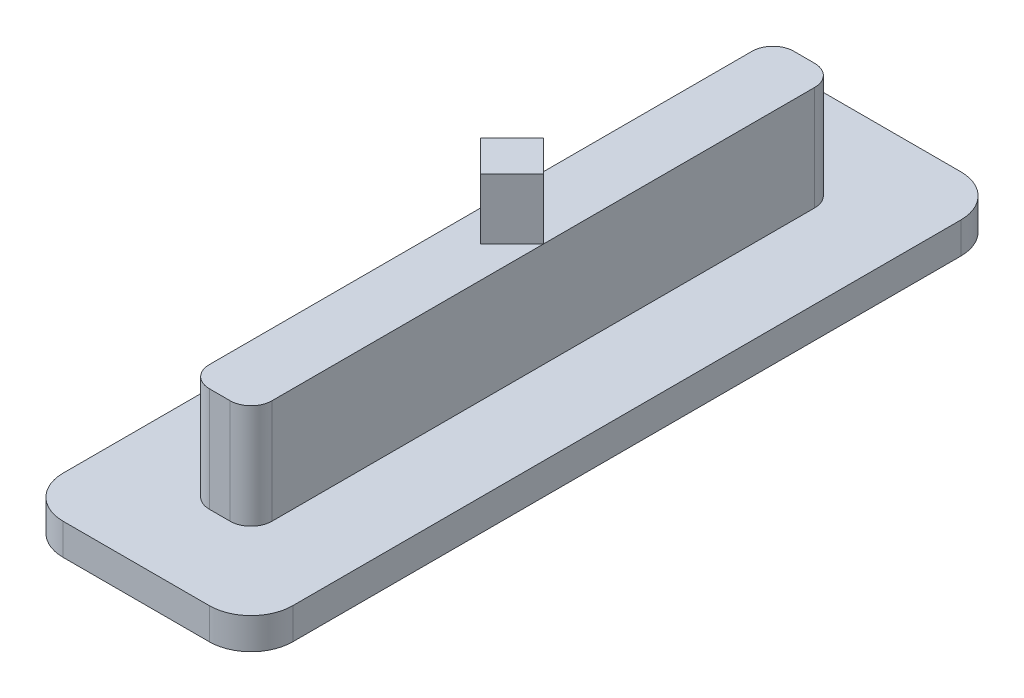
ISO-10303-21;
HEADER;
FILE_DESCRIPTION(('STEP AP214'),'2;1');
FILE_NAME('part.step','',(''),(''),'','','');
FILE_SCHEMA(('AUTOMOTIVE_DESIGN { 1 0 10303 214 1 1 1 1 }'));
ENDSEC;
DATA;
#1=APPLICATION_CONTEXT('core data for automotive mechanical design processes');
#2=APPLICATION_PROTOCOL_DEFINITION('international standard','automotive_design',2000,#1);
#3=PRODUCT_CONTEXT('',#1,'mechanical');
#4=PRODUCT('Part','Part','',(#3));
#5=PRODUCT_RELATED_PRODUCT_CATEGORY('part','',(#4));
#6=PRODUCT_DEFINITION_FORMATION('','',#4);
#7=PRODUCT_DEFINITION_CONTEXT('part definition',#1,'design');
#8=PRODUCT_DEFINITION('design','',#6,#7);
#9=PRODUCT_DEFINITION_SHAPE('','',#8);
#10=(LENGTH_UNIT() NAMED_UNIT(*) SI_UNIT(.MILLI.,.METRE.));
#11=(NAMED_UNIT(*) PLANE_ANGLE_UNIT() SI_UNIT($,.RADIAN.));
#12=(NAMED_UNIT(*) SI_UNIT($,.STERADIAN.) SOLID_ANGLE_UNIT());
#13=UNCERTAINTY_MEASURE_WITH_UNIT(LENGTH_MEASURE(1.E-05),#10,'distance_accuracy_value','');
#14=(GEOMETRIC_REPRESENTATION_CONTEXT(3) GLOBAL_UNCERTAINTY_ASSIGNED_CONTEXT((#13)) GLOBAL_UNIT_ASSIGNED_CONTEXT((#10,
#11,#12)) REPRESENTATION_CONTEXT('',''));
#15=CARTESIAN_POINT('',(0.,0.,0.));
#16=DIRECTION('',(0.,0.,1.));
#17=DIRECTION('',(1.,0.,0.));
#18=AXIS2_PLACEMENT_3D('',#15,#16,#17);
#19=CARTESIAN_POINT('',(0.,5.,0.));
#20=DIRECTION('',(0.,-1.,0.));
#21=DIRECTION('',(0.,0.,-1.));
#22=AXIS2_PLACEMENT_3D('',#19,#20,#21);
#23=PLANE('',#22);
#24=DIRECTION('',(0.707106781186548,0.,0.707106781186548));
#25=VECTOR('',#24,1.);
#26=CARTESIAN_POINT('',(0.,5.,1.5));
#27=LINE('',#26,#25);
#28=CARTESIAN_POINT('',(-1.5,5.,0.));
#29=VERTEX_POINT('',#28);
#30=CARTESIAN_POINT('',(0.,5.,1.5));
#31=VERTEX_POINT('',#30);
#32=EDGE_CURVE('E192',#29,#31,#27,.T.);
#33=ORIENTED_EDGE('',*,*,#32,.F.);
#34=DIRECTION('',(0.,0.,1.));
#35=VECTOR('',#34,1.);
#36=CARTESIAN_POINT('',(-1.5,5.,-14.));
#37=LINE('',#36,#35);
#38=CARTESIAN_POINT('',(-1.5,5.,13.));
#39=VERTEX_POINT('',#38);
#40=EDGE_CURVE('E226',#29,#39,#37,.T.);
#41=ORIENTED_EDGE('',*,*,#40,.T.);
#42=CARTESIAN_POINT('',(-0.499999999999998,5.,13.));
#43=DIRECTION('',(0.,-1.,0.));
#44=DIRECTION('',(0.,0.,-1.));
#45=AXIS2_PLACEMENT_3D('',#42,#43,#44);
#46=CIRCLE('',#45,1.);
#47=CARTESIAN_POINT('',(-0.499999999999998,5.,14.));
#48=VERTEX_POINT('',#47);
#49=EDGE_CURVE('E257',#39,#48,#46,.F.);
#50=ORIENTED_EDGE('',*,*,#49,.T.);
#51=DIRECTION('',(1.,0.,0.));
#52=VECTOR('',#51,1.);
#53=CARTESIAN_POINT('',(1.5,5.,14.));
#54=LINE('',#53,#52);
#55=CARTESIAN_POINT('',(0.500000000000002,5.,14.));
#56=VERTEX_POINT('',#55);
#57=EDGE_CURVE('E225',#48,#56,#54,.T.);
#58=ORIENTED_EDGE('',*,*,#57,.T.);
#59=CARTESIAN_POINT('',(0.500000000000002,5.,13.));
#60=DIRECTION('',(0.,-1.,0.));
#61=DIRECTION('',(0.,0.,-1.));
#62=AXIS2_PLACEMENT_3D('',#59,#60,#61);
#63=CIRCLE('',#62,1.);
#64=CARTESIAN_POINT('',(1.5,5.,13.));
#65=VERTEX_POINT('',#64);
#66=EDGE_CURVE('E259',#56,#65,#63,.F.);
#67=ORIENTED_EDGE('',*,*,#66,.T.);
#68=DIRECTION('',(0.,0.,-1.));
#69=VECTOR('',#68,1.);
#70=CARTESIAN_POINT('',(1.5,5.,-14.));
#71=LINE('',#70,#69);
#72=CARTESIAN_POINT('',(1.5,5.,0.));
#73=VERTEX_POINT('',#72);
#74=EDGE_CURVE('E230',#65,#73,#71,.T.);
#75=ORIENTED_EDGE('',*,*,#74,.T.);
#76=DIRECTION('',(0.707106781186548,0.,-0.707106781186548));
#77=VECTOR('',#76,1.);
#78=CARTESIAN_POINT('',(1.5,5.,0.));
#79=LINE('',#78,#77);
#80=EDGE_CURVE('E56',#31,#73,#79,.T.);
#81=ORIENTED_EDGE('',*,*,#80,.F.);
#82=EDGE_LOOP('',(#33,#41,#50,#58,#67,#75,#81));
#83=FACE_BOUND('',#82,.T.);
#84=ADVANCED_FACE('F33',(#83),#23,.F.);
#85=DIRECTION('',(-0.707106781186548,0.,0.707106781186548));
#86=VECTOR('',#85,1.);
#87=CARTESIAN_POINT('',(-1.5,5.,0.));
#88=LINE('',#87,#86);
#89=CARTESIAN_POINT('',(0.,5.,-1.5));
#90=VERTEX_POINT('',#89);
#91=EDGE_CURVE('E48',#90,#29,#88,.T.);
#92=ORIENTED_EDGE('',*,*,#91,.F.);
#93=DIRECTION('',(-0.707106781186548,0.,-0.707106781186548));
#94=VECTOR('',#93,1.);
#95=CARTESIAN_POINT('',(0.,5.,-1.5));
#96=LINE('',#95,#94);
#97=EDGE_CURVE('E576',#73,#90,#96,.T.);
#98=ORIENTED_EDGE('',*,*,#97,.F.);
#99=CARTESIAN_POINT('',(1.5,5.,-13.));
#100=VERTEX_POINT('',#99);
#101=EDGE_CURVE('E229',#73,#100,#71,.T.);
#102=ORIENTED_EDGE('',*,*,#101,.T.);
#103=CARTESIAN_POINT('',(0.499999999999999,5.,-13.));
#104=DIRECTION('',(0.,-1.,0.));
#105=DIRECTION('',(0.,0.,-1.));
#106=AXIS2_PLACEMENT_3D('',#103,#104,#105);
#107=CIRCLE('',#106,1.);
#108=CARTESIAN_POINT('',(0.499999999999999,5.,-14.));
#109=VERTEX_POINT('',#108);
#110=EDGE_CURVE('E263',#100,#109,#107,.F.);
#111=ORIENTED_EDGE('',*,*,#110,.T.);
#112=DIRECTION('',(-1.,0.,0.));
#113=VECTOR('',#112,1.);
#114=CARTESIAN_POINT('',(1.5,5.,-14.));
#115=LINE('',#114,#113);
#116=CARTESIAN_POINT('',(-0.500000000000002,5.,-14.));
#117=VERTEX_POINT('',#116);
#118=EDGE_CURVE('E232',#109,#117,#115,.T.);
#119=ORIENTED_EDGE('',*,*,#118,.T.);
#120=CARTESIAN_POINT('',(-0.500000000000002,5.,-13.));
#121=DIRECTION('',(0.,-1.,0.));
#122=DIRECTION('',(0.,0.,-1.));
#123=AXIS2_PLACEMENT_3D('',#120,#121,#122);
#124=CIRCLE('',#123,1.);
#125=CARTESIAN_POINT('',(-1.5,5.,-13.));
#126=VERTEX_POINT('',#125);
#127=EDGE_CURVE('E261',#117,#126,#124,.F.);
#128=ORIENTED_EDGE('',*,*,#127,.T.);
#129=EDGE_CURVE('E223',#126,#29,#37,.T.);
#130=ORIENTED_EDGE('',*,*,#129,.T.);
#131=EDGE_LOOP('',(#92,#98,#102,#111,#119,#128,#130));
#132=FACE_BOUND('',#131,.T.);
#133=ADVANCED_FACE('F362',(#132),#23,.F.);
#134=CARTESIAN_POINT('',(-1.5,5.,-14.));
#135=DIRECTION('',(1.,0.,0.));
#136=DIRECTION('',(0.,0.,-1.));
#137=AXIS2_PLACEMENT_3D('',#134,#135,#136);
#138=PLANE('',#137);
#139=ORIENTED_EDGE('',*,*,#129,.F.);
#140=DIRECTION('',(0.,-1.,0.));
#141=VECTOR('',#140,1.);
#142=CARTESIAN_POINT('',(-1.5,5.,-13.));
#143=LINE('',#142,#141);
#144=CARTESIAN_POINT('',(-1.5,0.,-13.));
#145=VERTEX_POINT('',#144);
#146=EDGE_CURVE('E268',#126,#145,#143,.T.);
#147=ORIENTED_EDGE('',*,*,#146,.T.);
#148=DIRECTION('',(0.,0.,1.));
#149=VECTOR('',#148,1.);
#150=CARTESIAN_POINT('',(-1.5,0.,-14.));
#151=LINE('',#150,#149);
#152=CARTESIAN_POINT('',(-1.5,0.,13.));
#153=VERTEX_POINT('',#152);
#154=EDGE_CURVE('E214',#145,#153,#151,.T.);
#155=ORIENTED_EDGE('',*,*,#154,.T.);
#156=DIRECTION('',(0.,-1.,0.));
#157=VECTOR('',#156,1.);
#158=CARTESIAN_POINT('',(-1.5,5.,13.));
#159=LINE('',#158,#157);
#160=EDGE_CURVE('E265',#153,#39,#159,.F.);
#161=ORIENTED_EDGE('',*,*,#160,.T.);
#162=ORIENTED_EDGE('',*,*,#40,.F.);
#163=EDGE_LOOP('',(#139,#147,#155,#161,#162));
#164=FACE_BOUND('',#163,.T.);
#165=ADVANCED_FACE('F367',(#164),#138,.F.);
#166=CARTESIAN_POINT('',(1.5,5.,14.));
#167=DIRECTION('',(0.,0.,-1.));
#168=DIRECTION('',(-1.,0.,0.));
#169=AXIS2_PLACEMENT_3D('',#166,#167,#168);
#170=PLANE('',#169);
#171=DIRECTION('',(1.,0.,0.));
#172=VECTOR('',#171,1.);
#173=CARTESIAN_POINT('',(1.5,0.,14.));
#174=LINE('',#173,#172);
#175=CARTESIAN_POINT('',(-0.499999999999998,0.,14.));
#176=VERTEX_POINT('',#175);
#177=CARTESIAN_POINT('',(0.500000000000002,0.,14.));
#178=VERTEX_POINT('',#177);
#179=EDGE_CURVE('E238',#176,#178,#174,.T.);
#180=ORIENTED_EDGE('',*,*,#179,.T.);
#181=DIRECTION('',(0.,-1.,0.));
#182=VECTOR('',#181,1.);
#183=CARTESIAN_POINT('',(0.500000000000002,5.,14.));
#184=LINE('',#183,#182);
#185=EDGE_CURVE('E274',#178,#56,#184,.F.);
#186=ORIENTED_EDGE('',*,*,#185,.T.);
#187=ORIENTED_EDGE('',*,*,#57,.F.);
#188=DIRECTION('',(0.,-1.,0.));
#189=VECTOR('',#188,1.);
#190=CARTESIAN_POINT('',(-0.499999999999998,5.,14.));
#191=LINE('',#190,#189);
#192=EDGE_CURVE('E271',#48,#176,#191,.T.);
#193=ORIENTED_EDGE('',*,*,#192,.T.);
#194=EDGE_LOOP('',(#180,#186,#187,#193));
#195=FACE_BOUND('',#194,.T.);
#196=ADVANCED_FACE('F378',(#195),#170,.F.);
#197=CARTESIAN_POINT('',(1.5,5.,-14.));
#198=DIRECTION('',(-1.,0.,0.));
#199=DIRECTION('',(0.,0.,1.));
#200=AXIS2_PLACEMENT_3D('',#197,#198,#199);
#201=PLANE('',#200);
#202=DIRECTION('',(0.,0.,-1.));
#203=VECTOR('',#202,1.);
#204=CARTESIAN_POINT('',(1.5,0.,-14.));
#205=LINE('',#204,#203);
#206=CARTESIAN_POINT('',(1.5,0.,13.));
#207=VERTEX_POINT('',#206);
#208=CARTESIAN_POINT('',(1.5,0.,-13.));
#209=VERTEX_POINT('',#208);
#210=EDGE_CURVE('E241',#207,#209,#205,.T.);
#211=ORIENTED_EDGE('',*,*,#210,.T.);
#212=DIRECTION('',(0.,-1.,0.));
#213=VECTOR('',#212,1.);
#214=CARTESIAN_POINT('',(1.5,5.,-13.));
#215=LINE('',#214,#213);
#216=EDGE_CURVE('E254',#209,#100,#215,.F.);
#217=ORIENTED_EDGE('',*,*,#216,.T.);
#218=ORIENTED_EDGE('',*,*,#101,.F.);
#219=ORIENTED_EDGE('',*,*,#74,.F.);
#220=DIRECTION('',(0.,-1.,0.));
#221=VECTOR('',#220,1.);
#222=CARTESIAN_POINT('',(1.5,5.,13.));
#223=LINE('',#222,#221);
#224=EDGE_CURVE('E251',#65,#207,#223,.T.);
#225=ORIENTED_EDGE('',*,*,#224,.T.);
#226=EDGE_LOOP('',(#211,#217,#218,#219,#225));
#227=FACE_BOUND('',#226,.T.);
#228=ADVANCED_FACE('F374',(#227),#201,.F.);
#229=CARTESIAN_POINT('',(1.5,5.,-14.));
#230=DIRECTION('',(0.,0.,1.));
#231=DIRECTION('',(1.,0.,0.));
#232=AXIS2_PLACEMENT_3D('',#229,#230,#231);
#233=PLANE('',#232);
#234=ORIENTED_EDGE('',*,*,#118,.F.);
#235=DIRECTION('',(0.,-1.,0.));
#236=VECTOR('',#235,1.);
#237=CARTESIAN_POINT('',(0.499999999999999,5.,-14.));
#238=LINE('',#237,#236);
#239=CARTESIAN_POINT('',(0.499999999999999,0.,-14.));
#240=VERTEX_POINT('',#239);
#241=EDGE_CURVE('E248',#109,#240,#238,.T.);
#242=ORIENTED_EDGE('',*,*,#241,.T.);
#243=DIRECTION('',(-1.,0.,0.));
#244=VECTOR('',#243,1.);
#245=CARTESIAN_POINT('',(1.5,0.,-14.));
#246=LINE('',#245,#244);
#247=CARTESIAN_POINT('',(-0.500000000000002,0.,-14.));
#248=VERTEX_POINT('',#247);
#249=EDGE_CURVE('E244',#240,#248,#246,.T.);
#250=ORIENTED_EDGE('',*,*,#249,.T.);
#251=DIRECTION('',(0.,-1.,0.));
#252=VECTOR('',#251,1.);
#253=CARTESIAN_POINT('',(-0.500000000000002,5.,-14.));
#254=LINE('',#253,#252);
#255=EDGE_CURVE('E235',#248,#117,#254,.F.);
#256=ORIENTED_EDGE('',*,*,#255,.T.);
#257=EDGE_LOOP('',(#234,#242,#250,#256));
#258=FACE_BOUND('',#257,.T.);
#259=ADVANCED_FACE('F371',(#258),#233,.F.);
#260=CARTESIAN_POINT('',(0.,0.,0.));
#261=DIRECTION('',(0.,1.,0.));
#262=DIRECTION('',(0.,0.,1.));
#263=AXIS2_PLACEMENT_3D('',#260,#261,#262);
#264=PLANE('',#263);
#265=DIRECTION('',(-1.,0.,0.));
#266=VECTOR('',#265,1.);
#267=CARTESIAN_POINT('',(-5.50000000000001,0.,18.));
#268=LINE('',#267,#266);
#269=CARTESIAN_POINT('',(3.49999999999999,0.,18.));
#270=VERTEX_POINT('',#269);
#271=CARTESIAN_POINT('',(-3.5,0.,18.));
#272=VERTEX_POINT('',#271);
#273=EDGE_CURVE('E196',#270,#272,#268,.T.);
#274=ORIENTED_EDGE('',*,*,#273,.F.);
#275=CARTESIAN_POINT('',(3.49999999999999,0.,16.));
#276=DIRECTION('',(0.,1.,0.));
#277=DIRECTION('',(0.,0.,1.));
#278=AXIS2_PLACEMENT_3D('',#275,#276,#277);
#279=CIRCLE('',#278,2.);
#280=CARTESIAN_POINT('',(5.49999999999999,0.,16.));
#281=VERTEX_POINT('',#280);
#282=EDGE_CURVE('E295',#270,#281,#279,.T.);
#283=ORIENTED_EDGE('',*,*,#282,.T.);
#284=DIRECTION('',(0.,0.,1.));
#285=VECTOR('',#284,1.);
#286=CARTESIAN_POINT('',(5.49999999999999,0.,-18.));
#287=LINE('',#286,#285);
#288=CARTESIAN_POINT('',(5.49999999999999,0.,-16.));
#289=VERTEX_POINT('',#288);
#290=EDGE_CURVE('E193',#289,#281,#287,.T.);
#291=ORIENTED_EDGE('',*,*,#290,.F.);
#292=CARTESIAN_POINT('',(3.49999999999999,0.,-16.));
#293=DIRECTION('',(0.,1.,0.));
#294=DIRECTION('',(0.,0.,1.));
#295=AXIS2_PLACEMENT_3D('',#292,#293,#294);
#296=CIRCLE('',#295,2.);
#297=CARTESIAN_POINT('',(3.49999999999999,0.,-18.));
#298=VERTEX_POINT('',#297);
#299=EDGE_CURVE('E291',#289,#298,#296,.T.);
#300=ORIENTED_EDGE('',*,*,#299,.T.);
#301=DIRECTION('',(1.,0.,0.));
#302=VECTOR('',#301,1.);
#303=CARTESIAN_POINT('',(-5.50000000000001,0.,-18.));
#304=LINE('',#303,#302);
#305=CARTESIAN_POINT('',(-3.5,0.,-18.));
#306=VERTEX_POINT('',#305);
#307=EDGE_CURVE('E206',#306,#298,#304,.T.);
#308=ORIENTED_EDGE('',*,*,#307,.F.);
#309=CARTESIAN_POINT('',(-3.5,0.,-16.));
#310=DIRECTION('',(0.,1.,0.));
#311=DIRECTION('',(0.,0.,1.));
#312=AXIS2_PLACEMENT_3D('',#309,#310,#311);
#313=CIRCLE('',#312,2.);
#314=CARTESIAN_POINT('',(-5.50000000000001,0.,-16.));
#315=VERTEX_POINT('',#314);
#316=EDGE_CURVE('E289',#306,#315,#313,.T.);
#317=ORIENTED_EDGE('',*,*,#316,.T.);
#318=DIRECTION('',(0.,0.,-1.));
#319=VECTOR('',#318,1.);
#320=CARTESIAN_POINT('',(-5.50000000000001,0.,-18.));
#321=LINE('',#320,#319);
#322=CARTESIAN_POINT('',(-5.50000000000001,0.,16.));
#323=VERTEX_POINT('',#322);
#324=EDGE_CURVE('E218',#323,#315,#321,.T.);
#325=ORIENTED_EDGE('',*,*,#324,.F.);
#326=CARTESIAN_POINT('',(-3.5,0.,16.));
#327=DIRECTION('',(0.,1.,0.));
#328=DIRECTION('',(0.,0.,1.));
#329=AXIS2_PLACEMENT_3D('',#326,#327,#328);
#330=CIRCLE('',#329,2.);
#331=EDGE_CURVE('E293',#323,#272,#330,.T.);
#332=ORIENTED_EDGE('',*,*,#331,.T.);
#333=EDGE_LOOP('',(#274,#283,#291,#300,#308,#317,#325,#332));
#334=FACE_BOUND('',#333,.T.);
#335=ORIENTED_EDGE('',*,*,#154,.F.);
#336=CARTESIAN_POINT('',(-0.500000000000002,0.,-13.));
#337=DIRECTION('',(0.,1.,0.));
#338=DIRECTION('',(0.,0.,1.));
#339=AXIS2_PLACEMENT_3D('',#336,#337,#338);
#340=CIRCLE('',#339,1.);
#341=EDGE_CURVE('E278',#145,#248,#340,.F.);
#342=ORIENTED_EDGE('',*,*,#341,.T.);
#343=ORIENTED_EDGE('',*,*,#249,.F.);
#344=CARTESIAN_POINT('',(0.499999999999999,0.,-13.));
#345=DIRECTION('',(0.,1.,0.));
#346=DIRECTION('',(0.,0.,1.));
#347=AXIS2_PLACEMENT_3D('',#344,#345,#346);
#348=CIRCLE('',#347,1.);
#349=EDGE_CURVE('E276',#240,#209,#348,.F.);
#350=ORIENTED_EDGE('',*,*,#349,.T.);
#351=ORIENTED_EDGE('',*,*,#210,.F.);
#352=CARTESIAN_POINT('',(0.500000000000002,0.,13.));
#353=DIRECTION('',(0.,1.,0.));
#354=DIRECTION('',(0.,0.,1.));
#355=AXIS2_PLACEMENT_3D('',#352,#353,#354);
#356=CIRCLE('',#355,1.);
#357=EDGE_CURVE('E280',#207,#178,#356,.F.);
#358=ORIENTED_EDGE('',*,*,#357,.T.);
#359=ORIENTED_EDGE('',*,*,#179,.F.);
#360=CARTESIAN_POINT('',(-0.499999999999998,0.,13.));
#361=DIRECTION('',(0.,1.,0.));
#362=DIRECTION('',(0.,0.,1.));
#363=AXIS2_PLACEMENT_3D('',#360,#361,#362);
#364=CIRCLE('',#363,1.);
#365=EDGE_CURVE('E282',#176,#153,#364,.F.);
#366=ORIENTED_EDGE('',*,*,#365,.T.);
#367=EDGE_LOOP('',(#335,#342,#343,#350,#351,#358,#359,#366));
#368=FACE_BOUND('',#367,.T.);
#369=ADVANCED_FACE('F325',(#334,#368),#264,.T.);
#370=CARTESIAN_POINT('',(5.49999999999999,-1.5,-18.));
#371=DIRECTION('',(-1.,0.,0.));
#372=DIRECTION('',(0.,0.,1.));
#373=AXIS2_PLACEMENT_3D('',#370,#371,#372);
#374=PLANE('',#373);
#375=ORIENTED_EDGE('',*,*,#290,.T.);
#376=DIRECTION('',(0.,1.,0.));
#377=VECTOR('',#376,1.);
#378=CARTESIAN_POINT('',(5.49999999999999,-1.5,16.));
#379=LINE('',#378,#377);
#380=CARTESIAN_POINT('',(5.49999999999999,-1.5,16.));
#381=VERTEX_POINT('',#380);
#382=EDGE_CURVE('E300',#281,#381,#379,.F.);
#383=ORIENTED_EDGE('',*,*,#382,.T.);
#384=DIRECTION('',(0.,0.,1.));
#385=VECTOR('',#384,1.);
#386=CARTESIAN_POINT('',(5.49999999999999,-1.5,-18.));
#387=LINE('',#386,#385);
#388=CARTESIAN_POINT('',(5.49999999999999,-1.5,-16.));
#389=VERTEX_POINT('',#388);
#390=EDGE_CURVE('E202',#389,#381,#387,.T.);
#391=ORIENTED_EDGE('',*,*,#390,.F.);
#392=DIRECTION('',(0.,1.,0.));
#393=VECTOR('',#392,1.);
#394=CARTESIAN_POINT('',(5.49999999999999,-1.5,-16.));
#395=LINE('',#394,#393);
#396=EDGE_CURVE('E297',#389,#289,#395,.T.);
#397=ORIENTED_EDGE('',*,*,#396,.T.);
#398=EDGE_LOOP('',(#375,#383,#391,#397));
#399=FACE_BOUND('',#398,.T.);
#400=ADVANCED_FACE('F335',(#399),#374,.F.);
#401=CARTESIAN_POINT('',(-5.50000000000001,-1.5,18.));
#402=DIRECTION('',(0.,0.,-1.));
#403=DIRECTION('',(-1.,0.,0.));
#404=AXIS2_PLACEMENT_3D('',#401,#402,#403);
#405=PLANE('',#404);
#406=DIRECTION('',(-1.,0.,0.));
#407=VECTOR('',#406,1.);
#408=CARTESIAN_POINT('',(-5.50000000000001,-1.5,18.));
#409=LINE('',#408,#407);
#410=CARTESIAN_POINT('',(3.49999999999999,-1.5,18.));
#411=VERTEX_POINT('',#410);
#412=CARTESIAN_POINT('',(-3.5,-1.5,18.));
#413=VERTEX_POINT('',#412);
#414=EDGE_CURVE('E205',#411,#413,#409,.T.);
#415=ORIENTED_EDGE('',*,*,#414,.F.);
#416=DIRECTION('',(0.,1.,0.));
#417=VECTOR('',#416,1.);
#418=CARTESIAN_POINT('',(3.49999999999999,-1.5,18.));
#419=LINE('',#418,#417);
#420=EDGE_CURVE('E286',#411,#270,#419,.T.);
#421=ORIENTED_EDGE('',*,*,#420,.T.);
#422=ORIENTED_EDGE('',*,*,#273,.T.);
#423=DIRECTION('',(0.,1.,0.));
#424=VECTOR('',#423,1.);
#425=CARTESIAN_POINT('',(-3.5,-1.5,18.));
#426=LINE('',#425,#424);
#427=EDGE_CURVE('E284',#272,#413,#426,.F.);
#428=ORIENTED_EDGE('',*,*,#427,.T.);
#429=EDGE_LOOP('',(#415,#421,#422,#428));
#430=FACE_BOUND('',#429,.T.);
#431=ADVANCED_FACE('F345',(#430),#405,.F.);
#432=CARTESIAN_POINT('',(-5.50000000000001,-1.5,-18.));
#433=DIRECTION('',(1.,0.,0.));
#434=DIRECTION('',(0.,0.,-1.));
#435=AXIS2_PLACEMENT_3D('',#432,#433,#434);
#436=PLANE('',#435);
#437=DIRECTION('',(0.,0.,-1.));
#438=VECTOR('',#437,1.);
#439=CARTESIAN_POINT('',(-5.50000000000001,-1.5,-18.));
#440=LINE('',#439,#438);
#441=CARTESIAN_POINT('',(-5.50000000000001,-1.5,16.));
#442=VERTEX_POINT('',#441);
#443=CARTESIAN_POINT('',(-5.50000000000001,-1.5,-16.));
#444=VERTEX_POINT('',#443);
#445=EDGE_CURVE('E209',#442,#444,#440,.T.);
#446=ORIENTED_EDGE('',*,*,#445,.F.);
#447=DIRECTION('',(0.,1.,0.));
#448=VECTOR('',#447,1.);
#449=CARTESIAN_POINT('',(-5.50000000000001,-1.5,16.));
#450=LINE('',#449,#448);
#451=EDGE_CURVE('E312',#442,#323,#450,.T.);
#452=ORIENTED_EDGE('',*,*,#451,.T.);
#453=ORIENTED_EDGE('',*,*,#324,.T.);
#454=DIRECTION('',(0.,1.,0.));
#455=VECTOR('',#454,1.);
#456=CARTESIAN_POINT('',(-5.50000000000001,-1.5,-16.));
#457=LINE('',#456,#455);
#458=EDGE_CURVE('E310',#315,#444,#457,.F.);
#459=ORIENTED_EDGE('',*,*,#458,.T.);
#460=EDGE_LOOP('',(#446,#452,#453,#459));
#461=FACE_BOUND('',#460,.T.);
#462=ADVANCED_FACE('F353',(#461),#436,.F.);
#463=CARTESIAN_POINT('',(-5.50000000000001,-1.5,-18.));
#464=DIRECTION('',(0.,0.,1.));
#465=DIRECTION('',(1.,0.,0.));
#466=AXIS2_PLACEMENT_3D('',#463,#464,#465);
#467=PLANE('',#466);
#468=ORIENTED_EDGE('',*,*,#307,.T.);
#469=DIRECTION('',(0.,1.,0.));
#470=VECTOR('',#469,1.);
#471=CARTESIAN_POINT('',(3.49999999999999,-1.5,-18.));
#472=LINE('',#471,#470);
#473=CARTESIAN_POINT('',(3.49999999999999,-1.5,-18.));
#474=VERTEX_POINT('',#473);
#475=EDGE_CURVE('E11',#298,#474,#472,.F.);
#476=ORIENTED_EDGE('',*,*,#475,.T.);
#477=DIRECTION('',(1.,0.,0.));
#478=VECTOR('',#477,1.);
#479=CARTESIAN_POINT('',(-5.50000000000001,-1.5,-18.));
#480=LINE('',#479,#478);
#481=CARTESIAN_POINT('',(-3.5,-1.5,-18.));
#482=VERTEX_POINT('',#481);
#483=EDGE_CURVE('E212',#482,#474,#480,.T.);
#484=ORIENTED_EDGE('',*,*,#483,.F.);
#485=DIRECTION('',(0.,1.,0.));
#486=VECTOR('',#485,1.);
#487=CARTESIAN_POINT('',(-3.5,-1.5,-18.));
#488=LINE('',#487,#486);
#489=EDGE_CURVE('E41',#482,#306,#488,.T.);
#490=ORIENTED_EDGE('',*,*,#489,.T.);
#491=EDGE_LOOP('',(#468,#476,#484,#490));
#492=FACE_BOUND('',#491,.T.);
#493=ADVANCED_FACE('F319',(#492),#467,.F.);
#494=CARTESIAN_POINT('',(0.,-1.5,0.));
#495=DIRECTION('',(0.,1.,0.));
#496=DIRECTION('',(0.,0.,1.));
#497=AXIS2_PLACEMENT_3D('',#494,#495,#496);
#498=PLANE('',#497);
#499=ORIENTED_EDGE('',*,*,#390,.T.);
#500=CARTESIAN_POINT('',(3.49999999999999,-1.5,16.));
#501=DIRECTION('',(0.,1.,0.));
#502=DIRECTION('',(0.,0.,1.));
#503=AXIS2_PLACEMENT_3D('',#500,#501,#502);
#504=CIRCLE('',#503,2.);
#505=EDGE_CURVE('E308',#381,#411,#504,.F.);
#506=ORIENTED_EDGE('',*,*,#505,.T.);
#507=ORIENTED_EDGE('',*,*,#414,.T.);
#508=CARTESIAN_POINT('',(-3.5,-1.5,16.));
#509=DIRECTION('',(0.,1.,0.));
#510=DIRECTION('',(0.,0.,1.));
#511=AXIS2_PLACEMENT_3D('',#508,#509,#510);
#512=CIRCLE('',#511,2.);
#513=EDGE_CURVE('E306',#413,#442,#512,.F.);
#514=ORIENTED_EDGE('',*,*,#513,.T.);
#515=ORIENTED_EDGE('',*,*,#445,.T.);
#516=CARTESIAN_POINT('',(-3.5,-1.5,-16.));
#517=DIRECTION('',(0.,1.,0.));
#518=DIRECTION('',(0.,0.,1.));
#519=AXIS2_PLACEMENT_3D('',#516,#517,#518);
#520=CIRCLE('',#519,2.);
#521=EDGE_CURVE('E302',#444,#482,#520,.F.);
#522=ORIENTED_EDGE('',*,*,#521,.T.);
#523=ORIENTED_EDGE('',*,*,#483,.T.);
#524=CARTESIAN_POINT('',(3.49999999999999,-1.5,-16.));
#525=DIRECTION('',(0.,1.,0.));
#526=DIRECTION('',(0.,0.,1.));
#527=AXIS2_PLACEMENT_3D('',#524,#525,#526);
#528=CIRCLE('',#527,2.);
#529=EDGE_CURVE('E304',#474,#389,#528,.F.);
#530=ORIENTED_EDGE('',*,*,#529,.T.);
#531=EDGE_LOOP('',(#499,#506,#507,#514,#515,#522,#523,#530));
#532=FACE_BOUND('',#531,.T.);
#533=ADVANCED_FACE('F339',(#532),#498,.F.);
#534=CARTESIAN_POINT('',(0.499999999999999,5.,-13.));
#535=DIRECTION('',(0.,-1.,0.));
#536=DIRECTION('',(0.,0.,-1.));
#537=AXIS2_PLACEMENT_3D('',#534,#535,#536);
#538=CYLINDRICAL_SURFACE('',#537,1.);
#539=ORIENTED_EDGE('',*,*,#110,.F.);
#540=ORIENTED_EDGE('',*,*,#216,.F.);
#541=ORIENTED_EDGE('',*,*,#349,.F.);
#542=ORIENTED_EDGE('',*,*,#241,.F.);
#543=EDGE_LOOP('',(#539,#540,#541,#542));
#544=FACE_BOUND('',#543,.T.);
#545=ADVANCED_FACE('F386',(#544),#538,.T.);
#546=CARTESIAN_POINT('',(-0.500000000000002,5.,-13.));
#547=DIRECTION('',(0.,-1.,0.));
#548=DIRECTION('',(0.,0.,-1.));
#549=AXIS2_PLACEMENT_3D('',#546,#547,#548);
#550=CYLINDRICAL_SURFACE('',#549,1.);
#551=ORIENTED_EDGE('',*,*,#127,.F.);
#552=ORIENTED_EDGE('',*,*,#255,.F.);
#553=ORIENTED_EDGE('',*,*,#341,.F.);
#554=ORIENTED_EDGE('',*,*,#146,.F.);
#555=EDGE_LOOP('',(#551,#552,#553,#554));
#556=FACE_BOUND('',#555,.T.);
#557=ADVANCED_FACE('F389',(#556),#550,.T.);
#558=CARTESIAN_POINT('',(0.500000000000002,5.,13.));
#559=DIRECTION('',(0.,-1.,0.));
#560=DIRECTION('',(0.,0.,-1.));
#561=AXIS2_PLACEMENT_3D('',#558,#559,#560);
#562=CYLINDRICAL_SURFACE('',#561,1.);
#563=ORIENTED_EDGE('',*,*,#66,.F.);
#564=ORIENTED_EDGE('',*,*,#185,.F.);
#565=ORIENTED_EDGE('',*,*,#357,.F.);
#566=ORIENTED_EDGE('',*,*,#224,.F.);
#567=EDGE_LOOP('',(#563,#564,#565,#566));
#568=FACE_BOUND('',#567,.T.);
#569=ADVANCED_FACE('F393',(#568),#562,.T.);
#570=CARTESIAN_POINT('',(-0.499999999999998,5.,13.));
#571=DIRECTION('',(0.,-1.,0.));
#572=DIRECTION('',(0.,0.,-1.));
#573=AXIS2_PLACEMENT_3D('',#570,#571,#572);
#574=CYLINDRICAL_SURFACE('',#573,1.);
#575=ORIENTED_EDGE('',*,*,#49,.F.);
#576=ORIENTED_EDGE('',*,*,#160,.F.);
#577=ORIENTED_EDGE('',*,*,#365,.F.);
#578=ORIENTED_EDGE('',*,*,#192,.F.);
#579=EDGE_LOOP('',(#575,#576,#577,#578));
#580=FACE_BOUND('',#579,.T.);
#581=ADVANCED_FACE('F397',(#580),#574,.T.);
#582=CARTESIAN_POINT('',(3.49999999999999,-1.5,16.));
#583=DIRECTION('',(0.,1.,0.));
#584=DIRECTION('',(0.,0.,1.));
#585=AXIS2_PLACEMENT_3D('',#582,#583,#584);
#586=CYLINDRICAL_SURFACE('',#585,2.);
#587=ORIENTED_EDGE('',*,*,#505,.F.);
#588=ORIENTED_EDGE('',*,*,#382,.F.);
#589=ORIENTED_EDGE('',*,*,#282,.F.);
#590=ORIENTED_EDGE('',*,*,#420,.F.);
#591=EDGE_LOOP('',(#587,#588,#589,#590));
#592=FACE_BOUND('',#591,.T.);
#593=ADVANCED_FACE('F343',(#592),#586,.T.);
#594=CARTESIAN_POINT('',(-3.5,-1.5,16.));
#595=DIRECTION('',(0.,1.,0.));
#596=DIRECTION('',(0.,0.,1.));
#597=AXIS2_PLACEMENT_3D('',#594,#595,#596);
#598=CYLINDRICAL_SURFACE('',#597,2.);
#599=ORIENTED_EDGE('',*,*,#513,.F.);
#600=ORIENTED_EDGE('',*,*,#427,.F.);
#601=ORIENTED_EDGE('',*,*,#331,.F.);
#602=ORIENTED_EDGE('',*,*,#451,.F.);
#603=EDGE_LOOP('',(#599,#600,#601,#602));
#604=FACE_BOUND('',#603,.T.);
#605=ADVANCED_FACE('F350',(#604),#598,.T.);
#606=CARTESIAN_POINT('',(3.49999999999999,-1.5,-16.));
#607=DIRECTION('',(0.,1.,0.));
#608=DIRECTION('',(0.,0.,1.));
#609=AXIS2_PLACEMENT_3D('',#606,#607,#608);
#610=CYLINDRICAL_SURFACE('',#609,2.);
#611=ORIENTED_EDGE('',*,*,#529,.F.);
#612=ORIENTED_EDGE('',*,*,#475,.F.);
#613=ORIENTED_EDGE('',*,*,#299,.F.);
#614=ORIENTED_EDGE('',*,*,#396,.F.);
#615=EDGE_LOOP('',(#611,#612,#613,#614));
#616=FACE_BOUND('',#615,.T.);
#617=ADVANCED_FACE('F332',(#616),#610,.T.);
#618=CARTESIAN_POINT('',(-3.5,-1.5,-16.));
#619=DIRECTION('',(0.,1.,0.));
#620=DIRECTION('',(0.,0.,1.));
#621=AXIS2_PLACEMENT_3D('',#618,#619,#620);
#622=CYLINDRICAL_SURFACE('',#621,2.);
#623=ORIENTED_EDGE('',*,*,#521,.F.);
#624=ORIENTED_EDGE('',*,*,#458,.F.);
#625=ORIENTED_EDGE('',*,*,#316,.F.);
#626=ORIENTED_EDGE('',*,*,#489,.F.);
#627=EDGE_LOOP('',(#623,#624,#625,#626));
#628=FACE_BOUND('',#627,.T.);
#629=ADVANCED_FACE('F35',(#628),#622,.T.);
#630=CARTESIAN_POINT('',(0.,7.9,1.5));
#631=DIRECTION('',(0.707106781186547,0.,-0.707106781186547));
#632=DIRECTION('',(-0.707106781186548,0.,-0.707106781186548));
#633=AXIS2_PLACEMENT_3D('',#630,#631,#632);
#634=PLANE('',#633);
#635=ORIENTED_EDGE('',*,*,#32,.T.);
#636=DIRECTION('',(0.,-1.,0.));
#637=VECTOR('',#636,1.);
#638=CARTESIAN_POINT('',(0.,7.9,1.5));
#639=LINE('',#638,#637);
#640=CARTESIAN_POINT('',(0.,7.9,1.5));
#641=VERTEX_POINT('',#640);
#642=EDGE_CURVE('E174',#641,#31,#639,.T.);
#643=ORIENTED_EDGE('',*,*,#642,.F.);
#644=DIRECTION('',(0.707106781186548,0.,0.707106781186548));
#645=VECTOR('',#644,1.);
#646=CARTESIAN_POINT('',(0.,7.9,1.5));
#647=LINE('',#646,#645);
#648=CARTESIAN_POINT('',(-1.5,7.9,0.));
#649=VERTEX_POINT('',#648);
#650=EDGE_CURVE('E181',#649,#641,#647,.T.);
#651=ORIENTED_EDGE('',*,*,#650,.F.);
#652=DIRECTION('',(0.,-1.,0.));
#653=VECTOR('',#652,1.);
#654=CARTESIAN_POINT('',(-1.5,7.9,0.));
#655=LINE('',#654,#653);
#656=EDGE_CURVE('E574',#649,#29,#655,.T.);
#657=ORIENTED_EDGE('',*,*,#656,.T.);
#658=EDGE_LOOP('',(#635,#643,#651,#657));
#659=FACE_BOUND('',#658,.T.);
#660=ADVANCED_FACE('F191',(#659),#634,.F.);
#661=CARTESIAN_POINT('',(1.5,7.9,0.));
#662=DIRECTION('',(-0.707106781186547,0.,-0.707106781186547));
#663=DIRECTION('',(-0.707106781186548,0.,0.707106781186548));
#664=AXIS2_PLACEMENT_3D('',#661,#662,#663);
#665=PLANE('',#664);
#666=ORIENTED_EDGE('',*,*,#80,.T.);
#667=DIRECTION('',(0.,-1.,0.));
#668=VECTOR('',#667,1.);
#669=CARTESIAN_POINT('',(1.5,7.9,0.));
#670=LINE('',#669,#668);
#671=CARTESIAN_POINT('',(1.5,7.9,0.));
#672=VERTEX_POINT('',#671);
#673=EDGE_CURVE('E177',#672,#73,#670,.T.);
#674=ORIENTED_EDGE('',*,*,#673,.F.);
#675=DIRECTION('',(0.707106781186548,0.,-0.707106781186548));
#676=VECTOR('',#675,1.);
#677=CARTESIAN_POINT('',(1.5,7.9,0.));
#678=LINE('',#677,#676);
#679=EDGE_CURVE('E170',#641,#672,#678,.T.);
#680=ORIENTED_EDGE('',*,*,#679,.F.);
#681=ORIENTED_EDGE('',*,*,#642,.T.);
#682=EDGE_LOOP('',(#666,#674,#680,#681));
#683=FACE_BOUND('',#682,.T.);
#684=ADVANCED_FACE('F172',(#683),#665,.F.);
#685=CARTESIAN_POINT('',(0.,7.9,-1.5));
#686=DIRECTION('',(-0.707106781186547,0.,0.707106781186547));
#687=DIRECTION('',(0.707106781186548,0.,0.707106781186548));
#688=AXIS2_PLACEMENT_3D('',#685,#686,#687);
#689=PLANE('',#688);
#690=ORIENTED_EDGE('',*,*,#97,.T.);
#691=DIRECTION('',(0.,-1.,0.));
#692=VECTOR('',#691,1.);
#693=CARTESIAN_POINT('',(0.,7.9,-1.5));
#694=LINE('',#693,#692);
#695=CARTESIAN_POINT('',(0.,7.9,-1.5));
#696=VERTEX_POINT('',#695);
#697=EDGE_CURVE('E198',#696,#90,#694,.T.);
#698=ORIENTED_EDGE('',*,*,#697,.F.);
#699=DIRECTION('',(-0.707106781186548,0.,-0.707106781186548));
#700=VECTOR('',#699,1.);
#701=CARTESIAN_POINT('',(0.,7.9,-1.5));
#702=LINE('',#701,#700);
#703=EDGE_CURVE('E180',#672,#696,#702,.T.);
#704=ORIENTED_EDGE('',*,*,#703,.F.);
#705=ORIENTED_EDGE('',*,*,#673,.T.);
#706=EDGE_LOOP('',(#690,#698,#704,#705));
#707=FACE_BOUND('',#706,.T.);
#708=ADVANCED_FACE('F456',(#707),#689,.F.);
#709=CARTESIAN_POINT('',(-1.5,7.9,0.));
#710=DIRECTION('',(0.707106781186547,0.,0.707106781186547));
#711=DIRECTION('',(0.707106781186548,0.,-0.707106781186548));
#712=AXIS2_PLACEMENT_3D('',#709,#710,#711);
#713=PLANE('',#712);
#714=ORIENTED_EDGE('',*,*,#91,.T.);
#715=ORIENTED_EDGE('',*,*,#656,.F.);
#716=DIRECTION('',(-0.707106781186548,0.,0.707106781186548));
#717=VECTOR('',#716,1.);
#718=CARTESIAN_POINT('',(-1.5,7.9,0.));
#719=LINE('',#718,#717);
#720=EDGE_CURVE('E186',#696,#649,#719,.T.);
#721=ORIENTED_EDGE('',*,*,#720,.F.);
#722=ORIENTED_EDGE('',*,*,#697,.T.);
#723=EDGE_LOOP('',(#714,#715,#721,#722));
#724=FACE_BOUND('',#723,.T.);
#725=ADVANCED_FACE('F465',(#724),#713,.F.);
#726=CARTESIAN_POINT('',(0.,7.9,0.));
#727=DIRECTION('',(0.,-1.,0.));
#728=DIRECTION('',(0.,0.,-1.));
#729=AXIS2_PLACEMENT_3D('',#726,#727,#728);
#730=PLANE('',#729);
#731=ORIENTED_EDGE('',*,*,#650,.T.);
#732=ORIENTED_EDGE('',*,*,#679,.T.);
#733=ORIENTED_EDGE('',*,*,#703,.T.);
#734=ORIENTED_EDGE('',*,*,#720,.T.);
#735=EDGE_LOOP('',(#731,#732,#733,#734));
#736=FACE_BOUND('',#735,.T.);
#737=ADVANCED_FACE('F184',(#736),#730,.F.);
#738=CLOSED_SHELL('',(#84,#133,#165,#196,#228,#259,#369,#400,#431,#462,#493,#533,#545,#557,#569,
#581,#593,#605,#617,#629,#660,#684,#708,#725,#737));
#739=MANIFOLD_SOLID_BREP('B2',#738);
#740=ADVANCED_BREP_SHAPE_REPRESENTATION('',(#18,#739),#14);
#741=SHAPE_DEFINITION_REPRESENTATION(#9,#740);
ENDSEC;
END-ISO-10303-21;
